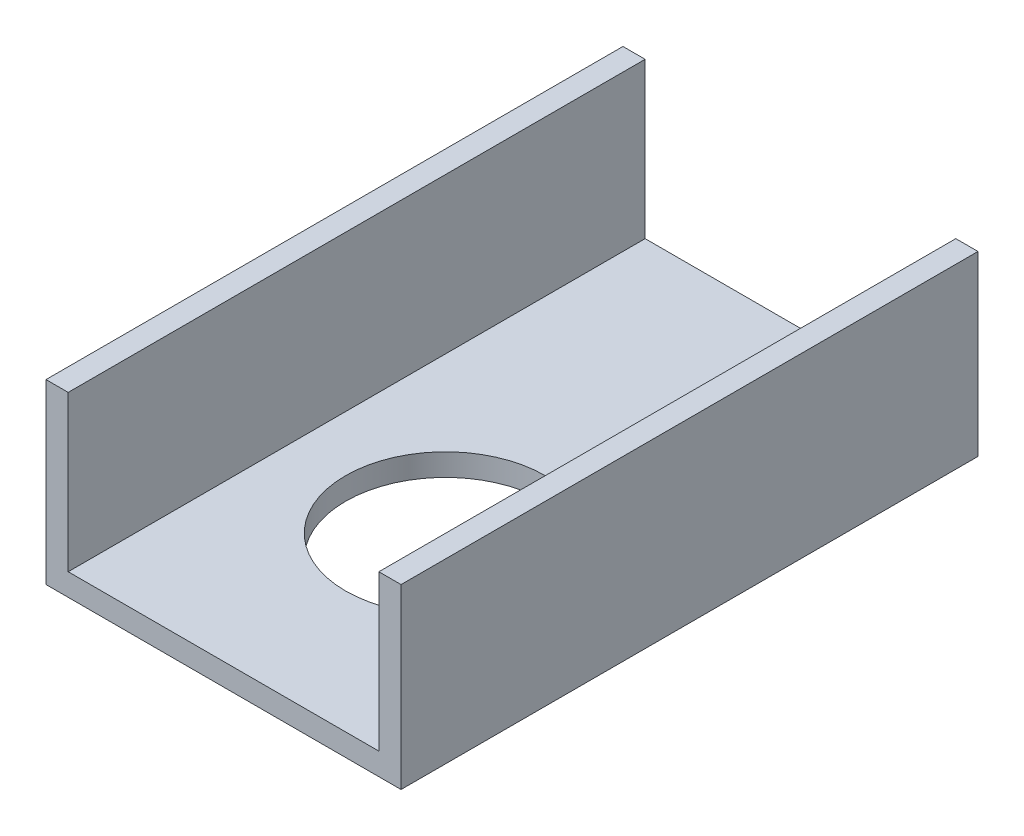
ISO-10303-21;
HEADER;
FILE_DESCRIPTION(('STEP AP214'),'2;1');
FILE_NAME('part.step','',(''),(''),'','','');
FILE_SCHEMA(('AUTOMOTIVE_DESIGN { 1 0 10303 214 1 1 1 1 }'));
ENDSEC;
DATA;
#1=APPLICATION_CONTEXT('core data for automotive mechanical design processes');
#2=APPLICATION_PROTOCOL_DEFINITION('international standard','automotive_design',2000,#1);
#3=PRODUCT_CONTEXT('',#1,'mechanical');
#4=PRODUCT('Part','Part','',(#3));
#5=PRODUCT_RELATED_PRODUCT_CATEGORY('part','',(#4));
#6=PRODUCT_DEFINITION_FORMATION('','',#4);
#7=PRODUCT_DEFINITION_CONTEXT('part definition',#1,'design');
#8=PRODUCT_DEFINITION('design','',#6,#7);
#9=PRODUCT_DEFINITION_SHAPE('','',#8);
#10=(LENGTH_UNIT() NAMED_UNIT(*) SI_UNIT(.MILLI.,.METRE.));
#11=(NAMED_UNIT(*) PLANE_ANGLE_UNIT() SI_UNIT($,.RADIAN.));
#12=(NAMED_UNIT(*) SI_UNIT($,.STERADIAN.) SOLID_ANGLE_UNIT());
#13=UNCERTAINTY_MEASURE_WITH_UNIT(LENGTH_MEASURE(1.E-05),#10,'distance_accuracy_value','');
#14=(GEOMETRIC_REPRESENTATION_CONTEXT(3) GLOBAL_UNCERTAINTY_ASSIGNED_CONTEXT((#13)) GLOBAL_UNIT_ASSIGNED_CONTEXT((#10,
#11,#12)) REPRESENTATION_CONTEXT('',''));
#15=CARTESIAN_POINT('',(0.,0.,0.));
#16=DIRECTION('',(0.,0.,1.));
#17=DIRECTION('',(1.,0.,0.));
#18=AXIS2_PLACEMENT_3D('',#15,#16,#17);
#19=CARTESIAN_POINT('',(0.,0.,0.));
#20=DIRECTION('',(0.,0.,-1.));
#21=DIRECTION('',(-1.,0.,0.));
#22=AXIS2_PLACEMENT_3D('',#19,#20,#21);
#23=PLANE('',#22);
#24=DIRECTION('',(0.,1.,0.));
#25=VECTOR('',#24,1.);
#26=CARTESIAN_POINT('',(44.45,-0.00100000000000013,0.));
#27=LINE('',#26,#25);
#28=CARTESIAN_POINT('',(44.45,0.,0.));
#29=VERTEX_POINT('',#28);
#30=CARTESIAN_POINT('',(44.45,3.175,0.));
#31=VERTEX_POINT('',#30);
#32=EDGE_CURVE('E194',#29,#31,#27,.T.);
#33=ORIENTED_EDGE('',*,*,#32,.F.);
#34=DIRECTION('',(1.,0.,0.));
#35=VECTOR('',#34,1.);
#36=CARTESIAN_POINT('',(0.,0.,0.));
#37=LINE('',#36,#35);
#38=CARTESIAN_POINT('',(0.,0.,0.));
#39=VERTEX_POINT('',#38);
#40=EDGE_CURVE('E136',#39,#29,#37,.T.);
#41=ORIENTED_EDGE('',*,*,#40,.F.);
#42=DIRECTION('',(0.,-1.,0.));
#43=VECTOR('',#42,1.);
#44=CARTESIAN_POINT('',(0.,0.,0.));
#45=LINE('',#44,#43);
#46=CARTESIAN_POINT('',(0.,25.4,0.));
#47=VERTEX_POINT('',#46);
#48=EDGE_CURVE('E131',#47,#39,#45,.T.);
#49=ORIENTED_EDGE('',*,*,#48,.F.);
#50=DIRECTION('',(-1.,0.,0.));
#51=VECTOR('',#50,1.);
#52=CARTESIAN_POINT('',(0.,25.4,0.));
#53=LINE('',#52,#51);
#54=CARTESIAN_POINT('',(3.175,25.4,0.));
#55=VERTEX_POINT('',#54);
#56=EDGE_CURVE('E82',#55,#47,#53,.T.);
#57=ORIENTED_EDGE('',*,*,#56,.F.);
#58=DIRECTION('',(0.,1.,0.));
#59=VECTOR('',#58,1.);
#60=CARTESIAN_POINT('',(3.175,3.175,0.));
#61=LINE('',#60,#59);
#62=CARTESIAN_POINT('',(3.175,3.175,0.));
#63=VERTEX_POINT('',#62);
#64=EDGE_CURVE('E76',#63,#55,#61,.T.);
#65=ORIENTED_EDGE('',*,*,#64,.F.);
#66=DIRECTION('',(-1.,0.,0.));
#67=VECTOR('',#66,1.);
#68=CARTESIAN_POINT('',(3.175,3.175,0.));
#69=LINE('',#68,#67);
#70=EDGE_CURVE('E121',#31,#63,#69,.T.);
#71=ORIENTED_EDGE('',*,*,#70,.F.);
#72=EDGE_LOOP('',(#33,#41,#49,#57,#65,#71));
#73=FACE_BOUND('',#72,.T.);
#74=ADVANCED_FACE('F32',(#73),#23,.T.);
#75=CARTESIAN_POINT('',(0.,0.,82.55));
#76=DIRECTION('',(1.,0.,0.));
#77=DIRECTION('',(0.,0.,-1.));
#78=AXIS2_PLACEMENT_3D('',#75,#76,#77);
#79=PLANE('',#78);
#80=ORIENTED_EDGE('',*,*,#48,.T.);
#81=DIRECTION('',(0.,0.,-1.));
#82=VECTOR('',#81,1.);
#83=CARTESIAN_POINT('',(0.,0.,82.55));
#84=LINE('',#83,#82);
#85=CARTESIAN_POINT('',(0.,0.,82.55));
#86=VERTEX_POINT('',#85);
#87=EDGE_CURVE('E11',#86,#39,#84,.T.);
#88=ORIENTED_EDGE('',*,*,#87,.F.);
#89=DIRECTION('',(0.,-1.,0.));
#90=VECTOR('',#89,1.);
#91=CARTESIAN_POINT('',(0.,0.,82.55));
#92=LINE('',#91,#90);
#93=CARTESIAN_POINT('',(0.,25.4,82.55));
#94=VERTEX_POINT('',#93);
#95=EDGE_CURVE('E149',#94,#86,#92,.T.);
#96=ORIENTED_EDGE('',*,*,#95,.F.);
#97=DIRECTION('',(0.,0.,-1.));
#98=VECTOR('',#97,1.);
#99=CARTESIAN_POINT('',(0.,25.4,82.55));
#100=LINE('',#99,#98);
#101=EDGE_CURVE('E127',#94,#47,#100,.T.);
#102=ORIENTED_EDGE('',*,*,#101,.T.);
#103=EDGE_LOOP('',(#80,#88,#96,#102));
#104=FACE_BOUND('',#103,.T.);
#105=ADVANCED_FACE('F34',(#104),#79,.F.);
#106=CARTESIAN_POINT('',(0.,0.,82.55));
#107=DIRECTION('',(0.,1.,0.));
#108=DIRECTION('',(0.,0.,1.));
#109=AXIS2_PLACEMENT_3D('',#106,#107,#108);
#110=PLANE('',#109);
#111=ORIENTED_EDGE('',*,*,#40,.T.);
#112=DIRECTION('',(0.,0.,-1.));
#113=VECTOR('',#112,1.);
#114=CARTESIAN_POINT('',(44.45,0.,22.225));
#115=LINE('',#114,#113);
#116=CARTESIAN_POINT('',(44.45,0.,22.225));
#117=VERTEX_POINT('',#116);
#118=EDGE_CURVE('E208',#117,#29,#115,.T.);
#119=ORIENTED_EDGE('',*,*,#118,.F.);
#120=DIRECTION('',(-1.,0.,0.));
#121=VECTOR('',#120,1.);
#122=CARTESIAN_POINT('',(44.45,0.,22.225));
#123=LINE('',#122,#121);
#124=CARTESIAN_POINT('',(47.625,0.,22.225));
#125=VERTEX_POINT('',#124);
#126=EDGE_CURVE('E191',#125,#117,#123,.T.);
#127=ORIENTED_EDGE('',*,*,#126,.F.);
#128=DIRECTION('',(0.,0.,1.));
#129=VECTOR('',#128,1.);
#130=CARTESIAN_POINT('',(47.625,0.,22.225));
#131=LINE('',#130,#129);
#132=CARTESIAN_POINT('',(47.625,0.,0.));
#133=VERTEX_POINT('',#132);
#134=EDGE_CURVE('E211',#133,#125,#131,.T.);
#135=ORIENTED_EDGE('',*,*,#134,.F.);
#136=CARTESIAN_POINT('',(50.8,0.,0.));
#137=VERTEX_POINT('',#136);
#138=EDGE_CURVE('E134',#133,#137,#37,.T.);
#139=ORIENTED_EDGE('',*,*,#138,.T.);
#140=DIRECTION('',(0.,0.,-1.));
#141=VECTOR('',#140,1.);
#142=CARTESIAN_POINT('',(50.8,0.,82.55));
#143=LINE('',#142,#141);
#144=CARTESIAN_POINT('',(50.8,0.,82.55));
#145=VERTEX_POINT('',#144);
#146=EDGE_CURVE('E41',#145,#137,#143,.T.);
#147=ORIENTED_EDGE('',*,*,#146,.F.);
#148=DIRECTION('',(1.,0.,0.));
#149=VECTOR('',#148,1.);
#150=CARTESIAN_POINT('',(0.,0.,82.55));
#151=LINE('',#150,#149);
#152=EDGE_CURVE('E90',#86,#145,#151,.T.);
#153=ORIENTED_EDGE('',*,*,#152,.F.);
#154=ORIENTED_EDGE('',*,*,#87,.T.);
#155=EDGE_LOOP('',(#111,#119,#127,#135,#139,#147,#153,#154));
#156=FACE_BOUND('',#155,.T.);
#157=CARTESIAN_POINT('',(25.4,0.,50.8));
#158=DIRECTION('',(0.,-1.,0.));
#159=DIRECTION('',(0.,0.,-1.));
#160=AXIS2_PLACEMENT_3D('',#157,#158,#159);
#161=CIRCLE('',#160,14.2875);
#162=CARTESIAN_POINT('',(25.4,0.,36.5125));
#163=VERTEX_POINT('',#162);
#164=EDGE_CURVE('E188',#163,#163,#161,.T.);
#165=ORIENTED_EDGE('',*,*,#164,.F.);
#166=EDGE_LOOP('',(#165));
#167=FACE_BOUND('',#166,.T.);
#168=ADVANCED_FACE('F219',(#156,#167),#110,.F.);
#169=CARTESIAN_POINT('',(50.8,0.,82.55));
#170=DIRECTION('',(-1.,0.,0.));
#171=DIRECTION('',(0.,0.,1.));
#172=AXIS2_PLACEMENT_3D('',#169,#170,#171);
#173=PLANE('',#172);
#174=DIRECTION('',(0.,1.,0.));
#175=VECTOR('',#174,1.);
#176=CARTESIAN_POINT('',(50.8,0.,0.));
#177=LINE('',#176,#175);
#178=CARTESIAN_POINT('',(50.8,25.4,0.));
#179=VERTEX_POINT('',#178);
#180=EDGE_CURVE('E139',#137,#179,#177,.T.);
#181=ORIENTED_EDGE('',*,*,#180,.T.);
#182=DIRECTION('',(0.,0.,-1.));
#183=VECTOR('',#182,1.);
#184=CARTESIAN_POINT('',(50.8,25.4,82.55));
#185=LINE('',#184,#183);
#186=CARTESIAN_POINT('',(50.8,25.4,82.55));
#187=VERTEX_POINT('',#186);
#188=EDGE_CURVE('E156',#187,#179,#185,.T.);
#189=ORIENTED_EDGE('',*,*,#188,.F.);
#190=DIRECTION('',(0.,1.,0.));
#191=VECTOR('',#190,1.);
#192=CARTESIAN_POINT('',(50.8,0.,82.55));
#193=LINE('',#192,#191);
#194=EDGE_CURVE('E164',#145,#187,#193,.T.);
#195=ORIENTED_EDGE('',*,*,#194,.F.);
#196=ORIENTED_EDGE('',*,*,#146,.T.);
#197=EDGE_LOOP('',(#181,#189,#195,#196));
#198=FACE_BOUND('',#197,.T.);
#199=ADVANCED_FACE('F162',(#198),#173,.F.);
#200=CARTESIAN_POINT('',(50.8,25.4,82.55));
#201=DIRECTION('',(0.,-1.,0.));
#202=DIRECTION('',(0.,0.,-1.));
#203=AXIS2_PLACEMENT_3D('',#200,#201,#202);
#204=PLANE('',#203);
#205=DIRECTION('',(-1.,0.,0.));
#206=VECTOR('',#205,1.);
#207=CARTESIAN_POINT('',(50.8,25.4,0.));
#208=LINE('',#207,#206);
#209=CARTESIAN_POINT('',(47.625,25.4,0.));
#210=VERTEX_POINT('',#209);
#211=EDGE_CURVE('E141',#179,#210,#208,.T.);
#212=ORIENTED_EDGE('',*,*,#211,.T.);
#213=DIRECTION('',(0.,0.,-1.));
#214=VECTOR('',#213,1.);
#215=CARTESIAN_POINT('',(47.625,25.4,82.55));
#216=LINE('',#215,#214);
#217=CARTESIAN_POINT('',(47.625,25.4,82.55));
#218=VERTEX_POINT('',#217);
#219=EDGE_CURVE('E153',#218,#210,#216,.T.);
#220=ORIENTED_EDGE('',*,*,#219,.F.);
#221=DIRECTION('',(-1.,0.,0.));
#222=VECTOR('',#221,1.);
#223=CARTESIAN_POINT('',(50.8,25.4,82.55));
#224=LINE('',#223,#222);
#225=EDGE_CURVE('E180',#187,#218,#224,.T.);
#226=ORIENTED_EDGE('',*,*,#225,.F.);
#227=ORIENTED_EDGE('',*,*,#188,.T.);
#228=EDGE_LOOP('',(#212,#220,#226,#227));
#229=FACE_BOUND('',#228,.T.);
#230=ADVANCED_FACE('F173',(#229),#204,.F.);
#231=CARTESIAN_POINT('',(47.625,3.175,82.55));
#232=DIRECTION('',(1.,0.,0.));
#233=DIRECTION('',(0.,0.,-1.));
#234=AXIS2_PLACEMENT_3D('',#231,#232,#233);
#235=PLANE('',#234);
#236=DIRECTION('',(0.,-1.,0.));
#237=VECTOR('',#236,1.);
#238=CARTESIAN_POINT('',(47.625,3.175,0.));
#239=LINE('',#238,#237);
#240=EDGE_CURVE('E143',#210,#133,#239,.T.);
#241=ORIENTED_EDGE('',*,*,#240,.T.);
#242=ORIENTED_EDGE('',*,*,#134,.T.);
#243=DIRECTION('',(0.,1.,0.));
#244=VECTOR('',#243,1.);
#245=CARTESIAN_POINT('',(47.625,-0.00100000000000013,22.225));
#246=LINE('',#245,#244);
#247=CARTESIAN_POINT('',(47.625,3.175,22.225));
#248=VERTEX_POINT('',#247);
#249=EDGE_CURVE('E198',#125,#248,#246,.T.);
#250=ORIENTED_EDGE('',*,*,#249,.T.);
#251=DIRECTION('',(0.,0.,-1.));
#252=VECTOR('',#251,1.);
#253=CARTESIAN_POINT('',(47.625,3.175,82.55));
#254=LINE('',#253,#252);
#255=CARTESIAN_POINT('',(47.625,3.175,82.55));
#256=VERTEX_POINT('',#255);
#257=EDGE_CURVE('E122',#256,#248,#254,.T.);
#258=ORIENTED_EDGE('',*,*,#257,.F.);
#259=DIRECTION('',(0.,-1.,0.));
#260=VECTOR('',#259,1.);
#261=CARTESIAN_POINT('',(47.625,3.175,82.55));
#262=LINE('',#261,#260);
#263=EDGE_CURVE('E111',#218,#256,#262,.T.);
#264=ORIENTED_EDGE('',*,*,#263,.F.);
#265=ORIENTED_EDGE('',*,*,#219,.T.);
#266=EDGE_LOOP('',(#241,#242,#250,#258,#264,#265));
#267=FACE_BOUND('',#266,.T.);
#268=ADVANCED_FACE('F176',(#267),#235,.F.);
#269=CARTESIAN_POINT('',(3.175,3.175,82.55));
#270=DIRECTION('',(0.,-1.,0.));
#271=DIRECTION('',(0.,0.,-1.));
#272=AXIS2_PLACEMENT_3D('',#269,#270,#271);
#273=PLANE('',#272);
#274=CARTESIAN_POINT('',(25.4,3.175,50.8));
#275=DIRECTION('',(0.,-1.,0.));
#276=DIRECTION('',(0.,0.,-1.));
#277=AXIS2_PLACEMENT_3D('',#274,#275,#276);
#278=CIRCLE('',#277,14.2875);
#279=CARTESIAN_POINT('',(25.4,3.175,36.5125));
#280=VERTEX_POINT('',#279);
#281=EDGE_CURVE('E135',#280,#280,#278,.F.);
#282=ORIENTED_EDGE('',*,*,#281,.F.);
#283=EDGE_LOOP('',(#282));
#284=FACE_BOUND('',#283,.T.);
#285=DIRECTION('',(1.,0.,0.));
#286=VECTOR('',#285,1.);
#287=CARTESIAN_POINT('',(44.45,3.175,22.225));
#288=LINE('',#287,#286);
#289=CARTESIAN_POINT('',(44.45,3.175,22.225));
#290=VERTEX_POINT('',#289);
#291=EDGE_CURVE('E199',#290,#248,#288,.T.);
#292=ORIENTED_EDGE('',*,*,#291,.F.);
#293=DIRECTION('',(0.,0.,1.));
#294=VECTOR('',#293,1.);
#295=CARTESIAN_POINT('',(44.45,3.175,22.225));
#296=LINE('',#295,#294);
#297=EDGE_CURVE('E205',#31,#290,#296,.T.);
#298=ORIENTED_EDGE('',*,*,#297,.F.);
#299=ORIENTED_EDGE('',*,*,#70,.T.);
#300=DIRECTION('',(0.,0.,-1.));
#301=VECTOR('',#300,1.);
#302=CARTESIAN_POINT('',(3.175,3.175,82.55));
#303=LINE('',#302,#301);
#304=CARTESIAN_POINT('',(3.175,3.175,82.55));
#305=VERTEX_POINT('',#304);
#306=EDGE_CURVE('E116',#305,#63,#303,.T.);
#307=ORIENTED_EDGE('',*,*,#306,.F.);
#308=DIRECTION('',(-1.,0.,0.));
#309=VECTOR('',#308,1.);
#310=CARTESIAN_POINT('',(3.175,3.175,82.55));
#311=LINE('',#310,#309);
#312=EDGE_CURVE('E105',#256,#305,#311,.T.);
#313=ORIENTED_EDGE('',*,*,#312,.F.);
#314=ORIENTED_EDGE('',*,*,#257,.T.);
#315=EDGE_LOOP('',(#292,#298,#299,#307,#313,#314));
#316=FACE_BOUND('',#315,.T.);
#317=ADVANCED_FACE('F118',(#284,#316),#273,.F.);
#318=CARTESIAN_POINT('',(3.175,3.175,82.55));
#319=DIRECTION('',(-1.,0.,0.));
#320=DIRECTION('',(0.,0.,1.));
#321=AXIS2_PLACEMENT_3D('',#318,#319,#320);
#322=PLANE('',#321);
#323=ORIENTED_EDGE('',*,*,#64,.T.);
#324=DIRECTION('',(0.,0.,-1.));
#325=VECTOR('',#324,1.);
#326=CARTESIAN_POINT('',(3.175,25.4,82.55));
#327=LINE('',#326,#325);
#328=CARTESIAN_POINT('',(3.175,25.4,82.55));
#329=VERTEX_POINT('',#328);
#330=EDGE_CURVE('E123',#329,#55,#327,.T.);
#331=ORIENTED_EDGE('',*,*,#330,.F.);
#332=DIRECTION('',(0.,1.,0.));
#333=VECTOR('',#332,1.);
#334=CARTESIAN_POINT('',(3.175,3.175,82.55));
#335=LINE('',#334,#333);
#336=EDGE_CURVE('E109',#305,#329,#335,.T.);
#337=ORIENTED_EDGE('',*,*,#336,.F.);
#338=ORIENTED_EDGE('',*,*,#306,.T.);
#339=EDGE_LOOP('',(#323,#331,#337,#338));
#340=FACE_BOUND('',#339,.T.);
#341=ADVANCED_FACE('F125',(#340),#322,.F.);
#342=CARTESIAN_POINT('',(0.,25.4,82.55));
#343=DIRECTION('',(0.,-1.,0.));
#344=DIRECTION('',(0.,0.,-1.));
#345=AXIS2_PLACEMENT_3D('',#342,#343,#344);
#346=PLANE('',#345);
#347=ORIENTED_EDGE('',*,*,#56,.T.);
#348=ORIENTED_EDGE('',*,*,#101,.F.);
#349=DIRECTION('',(-1.,0.,0.));
#350=VECTOR('',#349,1.);
#351=CARTESIAN_POINT('',(0.,25.4,82.55));
#352=LINE('',#351,#350);
#353=EDGE_CURVE('E49',#329,#94,#352,.T.);
#354=ORIENTED_EDGE('',*,*,#353,.F.);
#355=ORIENTED_EDGE('',*,*,#330,.T.);
#356=EDGE_LOOP('',(#347,#348,#354,#355));
#357=FACE_BOUND('',#356,.T.);
#358=ADVANCED_FACE('F238',(#357),#346,.F.);
#359=CARTESIAN_POINT('',(0.,0.,82.55));
#360=DIRECTION('',(0.,0.,-1.));
#361=DIRECTION('',(-1.,0.,0.));
#362=AXIS2_PLACEMENT_3D('',#359,#360,#361);
#363=PLANE('',#362);
#364=ORIENTED_EDGE('',*,*,#95,.T.);
#365=ORIENTED_EDGE('',*,*,#152,.T.);
#366=ORIENTED_EDGE('',*,*,#194,.T.);
#367=ORIENTED_EDGE('',*,*,#225,.T.);
#368=ORIENTED_EDGE('',*,*,#263,.T.);
#369=ORIENTED_EDGE('',*,*,#312,.T.);
#370=ORIENTED_EDGE('',*,*,#336,.T.);
#371=ORIENTED_EDGE('',*,*,#353,.T.);
#372=EDGE_LOOP('',(#364,#365,#366,#367,#368,#369,#370,#371));
#373=FACE_BOUND('',#372,.T.);
#374=ADVANCED_FACE('F107',(#373),#363,.F.);
#375=ORIENTED_EDGE('',*,*,#138,.F.);
#376=ORIENTED_EDGE('',*,*,#240,.F.);
#377=ORIENTED_EDGE('',*,*,#211,.F.);
#378=ORIENTED_EDGE('',*,*,#180,.F.);
#379=EDGE_LOOP('',(#375,#376,#377,#378));
#380=FACE_BOUND('',#379,.T.);
#381=ADVANCED_FACE('F168',(#380),#23,.T.);
#382=CARTESIAN_POINT('',(25.4,25.401,50.8));
#383=DIRECTION('',(0.,-1.,0.));
#384=DIRECTION('',(0.,0.,-1.));
#385=AXIS2_PLACEMENT_3D('',#382,#383,#384);
#386=CYLINDRICAL_SURFACE('',#385,14.2875);
#387=ORIENTED_EDGE('',*,*,#164,.T.);
#388=EDGE_LOOP('',(#387));
#389=FACE_BOUND('',#388,.T.);
#390=ORIENTED_EDGE('',*,*,#281,.T.);
#391=EDGE_LOOP('',(#390));
#392=FACE_BOUND('',#391,.T.);
#393=ADVANCED_FACE('F253',(#389,#392),#386,.F.);
#394=CARTESIAN_POINT('',(44.45,-0.00100000000000013,22.225));
#395=DIRECTION('',(-1.,0.,0.));
#396=DIRECTION('',(0.,0.,1.));
#397=AXIS2_PLACEMENT_3D('',#394,#395,#396);
#398=PLANE('',#397);
#399=ORIENTED_EDGE('',*,*,#118,.T.);
#400=ORIENTED_EDGE('',*,*,#32,.T.);
#401=ORIENTED_EDGE('',*,*,#297,.T.);
#402=DIRECTION('',(0.,1.,0.));
#403=VECTOR('',#402,1.);
#404=CARTESIAN_POINT('',(44.45,-0.00100000000000013,22.225));
#405=LINE('',#404,#403);
#406=EDGE_CURVE('E195',#117,#290,#405,.T.);
#407=ORIENTED_EDGE('',*,*,#406,.F.);
#408=EDGE_LOOP('',(#399,#400,#401,#407));
#409=FACE_BOUND('',#408,.T.);
#410=ADVANCED_FACE('F232',(#409),#398,.F.);
#411=CARTESIAN_POINT('',(44.45,-0.00100000000000013,22.225));
#412=DIRECTION('',(0.,0.,1.));
#413=DIRECTION('',(1.,0.,0.));
#414=AXIS2_PLACEMENT_3D('',#411,#412,#413);
#415=PLANE('',#414);
#416=ORIENTED_EDGE('',*,*,#126,.T.);
#417=ORIENTED_EDGE('',*,*,#406,.T.);
#418=ORIENTED_EDGE('',*,*,#291,.T.);
#419=ORIENTED_EDGE('',*,*,#249,.F.);
#420=EDGE_LOOP('',(#416,#417,#418,#419));
#421=FACE_BOUND('',#420,.T.);
#422=ADVANCED_FACE('F223',(#421),#415,.F.);
#423=CLOSED_SHELL('',(#74,#105,#168,#199,#230,#268,#317,#341,#358,#374,#381,#393,#410,#422));
#424=MANIFOLD_SOLID_BREP('B2',#423);
#425=ADVANCED_BREP_SHAPE_REPRESENTATION('',(#18,#424),#14);
#426=SHAPE_DEFINITION_REPRESENTATION(#9,#425);
ENDSEC;
END-ISO-10303-21;
